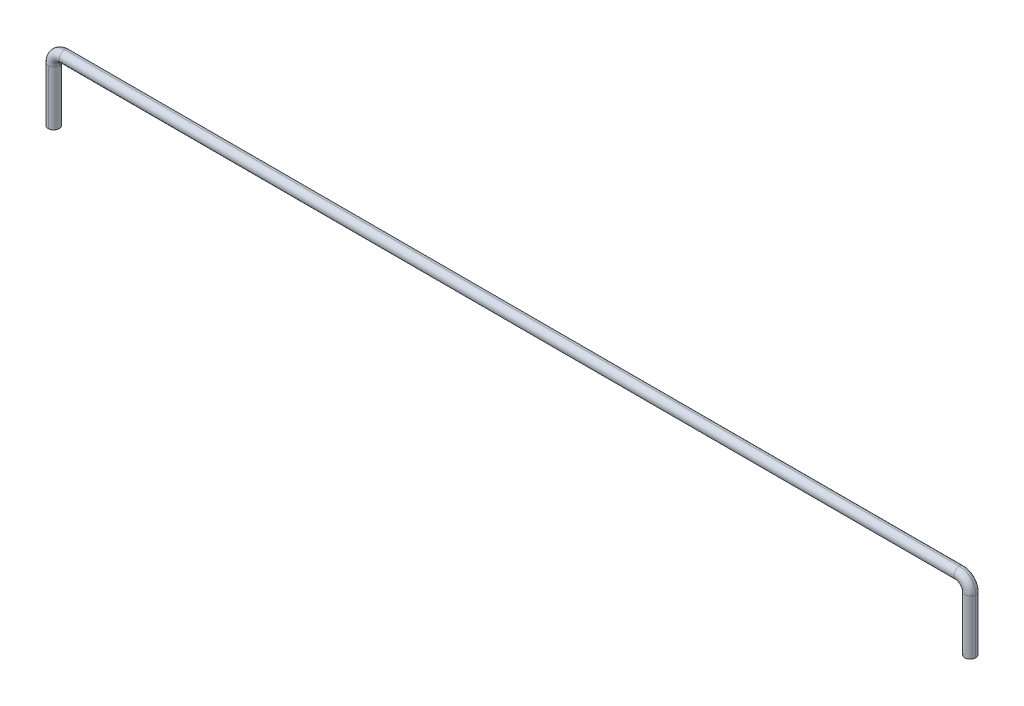
ISO-10303-21;
HEADER;
FILE_DESCRIPTION(('STEP AP214'),'2;1');
FILE_NAME('part.step','',(''),(''),'','','');
FILE_SCHEMA(('AUTOMOTIVE_DESIGN { 1 0 10303 214 1 1 1 1 }'));
ENDSEC;
DATA;
#1=APPLICATION_CONTEXT('core data for automotive mechanical design processes');
#2=APPLICATION_PROTOCOL_DEFINITION('international standard','automotive_design',2000,#1);
#3=PRODUCT_CONTEXT('',#1,'mechanical');
#4=PRODUCT('Part','Part','',(#3));
#5=PRODUCT_RELATED_PRODUCT_CATEGORY('part','',(#4));
#6=PRODUCT_DEFINITION_FORMATION('','',#4);
#7=PRODUCT_DEFINITION_CONTEXT('part definition',#1,'design');
#8=PRODUCT_DEFINITION('design','',#6,#7);
#9=PRODUCT_DEFINITION_SHAPE('','',#8);
#10=(LENGTH_UNIT() NAMED_UNIT(*) SI_UNIT(.MILLI.,.METRE.));
#11=(NAMED_UNIT(*) PLANE_ANGLE_UNIT() SI_UNIT($,.RADIAN.));
#12=(NAMED_UNIT(*) SI_UNIT($,.STERADIAN.) SOLID_ANGLE_UNIT());
#13=UNCERTAINTY_MEASURE_WITH_UNIT(LENGTH_MEASURE(1.E-05),#10,'distance_accuracy_value','');
#14=(GEOMETRIC_REPRESENTATION_CONTEXT(3) GLOBAL_UNCERTAINTY_ASSIGNED_CONTEXT((#13)) GLOBAL_UNIT_ASSIGNED_CONTEXT((#10,
#11,#12)) REPRESENTATION_CONTEXT('',''));
#15=CARTESIAN_POINT('',(0.,0.,0.));
#16=DIRECTION('',(0.,0.,1.));
#17=DIRECTION('',(1.,0.,0.));
#18=AXIS2_PLACEMENT_3D('',#15,#16,#17);
#19=CARTESIAN_POINT('',(41.9,0.,0.));
#20=DIRECTION('',(0.,-1.,0.));
#21=DIRECTION('',(-1.,0.,0.));
#22=AXIS2_PLACEMENT_3D('',#19,#20,#21);
#23=PLANE('',#22);
#24=CARTESIAN_POINT('',(41.9,0.,0.));
#25=DIRECTION('',(0.,-1.,0.));
#26=DIRECTION('',(0.,0.,1.));
#27=AXIS2_PLACEMENT_3D('',#24,#25,#26);
#28=CIRCLE('',#27,0.25);
#29=CARTESIAN_POINT('',(42.15,0.,0.));
#30=VERTEX_POINT('',#29);
#31=CARTESIAN_POINT('',(41.65,0.,0.));
#32=VERTEX_POINT('',#31);
#33=EDGE_CURVE('E92',#30,#32,#28,.T.);
#34=ORIENTED_EDGE('',*,*,#33,.T.);
#35=CARTESIAN_POINT('',(41.9,0.,0.));
#36=DIRECTION('',(0.,-1.,0.));
#37=DIRECTION('',(0.,0.,1.));
#38=AXIS2_PLACEMENT_3D('',#35,#36,#37);
#39=CIRCLE('',#38,0.25);
#40=EDGE_CURVE('E11',#32,#30,#39,.T.);
#41=ORIENTED_EDGE('',*,*,#40,.T.);
#42=EDGE_LOOP('',(#34,#41));
#43=FACE_BOUND('',#42,.T.);
#44=ADVANCED_FACE('F16',(#43),#23,.T.);
#45=CARTESIAN_POINT('',(0.5,2.5,0.));
#46=DIRECTION('',(0.,0.,-1.));
#47=DIRECTION('',(-1.,0.,0.));
#48=AXIS2_PLACEMENT_3D('',#45,#46,#47);
#49=TOROIDAL_SURFACE('',#48,0.5,0.25);
#50=CARTESIAN_POINT('',(0.5,2.5,0.));
#51=DIRECTION('',(0.,0.,-1.));
#52=DIRECTION('',(-1.,0.,0.));
#53=AXIS2_PLACEMENT_3D('',#50,#51,#52);
#54=CIRCLE('',#53,0.75);
#55=CARTESIAN_POINT('',(-0.25,2.5,0.));
#56=VERTEX_POINT('',#55);
#57=CARTESIAN_POINT('',(0.5,3.25,0.));
#58=VERTEX_POINT('',#57);
#59=EDGE_CURVE('E131',#56,#58,#54,.T.);
#60=ORIENTED_EDGE('',*,*,#59,.F.);
#61=CARTESIAN_POINT('',(0.,2.5,0.));
#62=DIRECTION('',(0.,1.,0.));
#63=DIRECTION('',(0.,0.,1.));
#64=AXIS2_PLACEMENT_3D('',#61,#62,#63);
#65=CIRCLE('',#64,0.25);
#66=CARTESIAN_POINT('',(0.,2.5,0.25));
#67=VERTEX_POINT('',#66);
#68=EDGE_CURVE('E156',#56,#67,#65,.T.);
#69=ORIENTED_EDGE('',*,*,#68,.T.);
#70=CARTESIAN_POINT('',(0.,2.5,0.));
#71=DIRECTION('',(0.,1.,0.));
#72=DIRECTION('',(0.,0.,1.));
#73=AXIS2_PLACEMENT_3D('',#70,#71,#72);
#74=CIRCLE('',#73,0.25);
#75=CARTESIAN_POINT('',(0.25,2.5,0.));
#76=VERTEX_POINT('',#75);
#77=EDGE_CURVE('E128',#67,#76,#74,.T.);
#78=ORIENTED_EDGE('',*,*,#77,.T.);
#79=CARTESIAN_POINT('',(0.5,2.5,0.));
#80=DIRECTION('',(0.,0.,-1.));
#81=DIRECTION('',(-1.,0.,0.));
#82=AXIS2_PLACEMENT_3D('',#79,#80,#81);
#83=CIRCLE('',#82,0.25);
#84=CARTESIAN_POINT('',(0.5,2.75,0.));
#85=VERTEX_POINT('',#84);
#86=EDGE_CURVE('E140',#76,#85,#83,.T.);
#87=ORIENTED_EDGE('',*,*,#86,.T.);
#88=CARTESIAN_POINT('',(0.5,3.,0.));
#89=DIRECTION('',(1.,0.,0.));
#90=DIRECTION('',(0.,0.,1.));
#91=AXIS2_PLACEMENT_3D('',#88,#89,#90);
#92=CIRCLE('',#91,0.25);
#93=EDGE_CURVE('E152',#58,#85,#92,.T.);
#94=ORIENTED_EDGE('',*,*,#93,.F.);
#95=EDGE_LOOP('',(#60,#69,#78,#87,#94));
#96=FACE_BOUND('',#95,.T.);
#97=ADVANCED_FACE('F181',(#96),#49,.T.);
#98=CARTESIAN_POINT('',(0.5,3.,0.));
#99=DIRECTION('',(1.,0.,0.));
#100=DIRECTION('',(0.,1.,0.));
#101=AXIS2_PLACEMENT_3D('',#98,#99,#100);
#102=CYLINDRICAL_SURFACE('',#101,0.25);
#103=DIRECTION('',(1.,0.,0.));
#104=VECTOR('',#103,1.);
#105=CARTESIAN_POINT('',(0.5,2.75,0.));
#106=LINE('',#105,#104);
#107=CARTESIAN_POINT('',(41.4,2.75,0.));
#108=VERTEX_POINT('',#107);
#109=EDGE_CURVE('E147',#85,#108,#106,.T.);
#110=ORIENTED_EDGE('',*,*,#109,.F.);
#111=CARTESIAN_POINT('',(0.5,3.,0.));
#112=DIRECTION('',(1.,0.,0.));
#113=DIRECTION('',(0.,0.,1.));
#114=AXIS2_PLACEMENT_3D('',#111,#112,#113);
#115=CIRCLE('',#114,0.25);
#116=EDGE_CURVE('E134',#85,#58,#115,.T.);
#117=ORIENTED_EDGE('',*,*,#116,.T.);
#118=DIRECTION('',(1.,0.,0.));
#119=VECTOR('',#118,1.);
#120=CARTESIAN_POINT('',(0.5,3.25,0.));
#121=LINE('',#120,#119);
#122=CARTESIAN_POINT('',(41.4,3.25,0.));
#123=VERTEX_POINT('',#122);
#124=EDGE_CURVE('E146',#58,#123,#121,.T.);
#125=ORIENTED_EDGE('',*,*,#124,.T.);
#126=CARTESIAN_POINT('',(41.4,3.,0.));
#127=DIRECTION('',(1.,0.,0.));
#128=DIRECTION('',(0.,0.,1.));
#129=AXIS2_PLACEMENT_3D('',#126,#127,#128);
#130=CIRCLE('',#129,0.25);
#131=EDGE_CURVE('E125',#108,#123,#130,.T.);
#132=ORIENTED_EDGE('',*,*,#131,.F.);
#133=EDGE_LOOP('',(#110,#117,#125,#132));
#134=FACE_BOUND('',#133,.T.);
#135=ADVANCED_FACE('F172',(#134),#102,.T.);
#136=CARTESIAN_POINT('',(41.4,2.5,0.));
#137=DIRECTION('',(0.,0.,-1.));
#138=DIRECTION('',(-1.,0.,0.));
#139=AXIS2_PLACEMENT_3D('',#136,#137,#138);
#140=TOROIDAL_SURFACE('',#139,0.5,0.25);
#141=CARTESIAN_POINT('',(41.4,2.5,0.));
#142=DIRECTION('',(0.,0.,-1.));
#143=DIRECTION('',(-1.,0.,0.));
#144=AXIS2_PLACEMENT_3D('',#141,#142,#143);
#145=CIRCLE('',#144,0.75);
#146=CARTESIAN_POINT('',(42.15,2.5,0.));
#147=VERTEX_POINT('',#146);
#148=EDGE_CURVE('E118',#123,#147,#145,.T.);
#149=ORIENTED_EDGE('',*,*,#148,.F.);
#150=CARTESIAN_POINT('',(41.4,3.,0.));
#151=DIRECTION('',(1.,0.,0.));
#152=DIRECTION('',(0.,0.,1.));
#153=AXIS2_PLACEMENT_3D('',#150,#151,#152);
#154=CIRCLE('',#153,0.25);
#155=EDGE_CURVE('E110',#123,#108,#154,.T.);
#156=ORIENTED_EDGE('',*,*,#155,.T.);
#157=CARTESIAN_POINT('',(41.4,2.5,0.));
#158=DIRECTION('',(0.,0.,-1.));
#159=DIRECTION('',(-1.,0.,0.));
#160=AXIS2_PLACEMENT_3D('',#157,#158,#159);
#161=CIRCLE('',#160,0.250000000000007);
#162=CARTESIAN_POINT('',(41.65,2.5,0.));
#163=VERTEX_POINT('',#162);
#164=EDGE_CURVE('E106',#108,#163,#161,.T.);
#165=ORIENTED_EDGE('',*,*,#164,.T.);
#166=CARTESIAN_POINT('',(41.9,2.5,0.));
#167=DIRECTION('',(0.,-1.,0.));
#168=DIRECTION('',(0.,0.,1.));
#169=AXIS2_PLACEMENT_3D('',#166,#167,#168);
#170=CIRCLE('',#169,0.25);
#171=EDGE_CURVE('E93',#147,#163,#170,.T.);
#172=ORIENTED_EDGE('',*,*,#171,.F.);
#173=EDGE_LOOP('',(#149,#156,#165,#172));
#174=FACE_BOUND('',#173,.T.);
#175=ADVANCED_FACE('F107',(#174),#140,.T.);
#176=CARTESIAN_POINT('',(41.9,2.5,0.));
#177=DIRECTION('',(0.,-1.,0.));
#178=DIRECTION('',(1.,0.,0.));
#179=AXIS2_PLACEMENT_3D('',#176,#177,#178);
#180=CYLINDRICAL_SURFACE('',#179,0.25);
#181=DIRECTION('',(0.,-1.,0.));
#182=VECTOR('',#181,1.);
#183=CARTESIAN_POINT('',(41.65,2.5,0.));
#184=LINE('',#183,#182);
#185=EDGE_CURVE('E81',#163,#32,#184,.T.);
#186=ORIENTED_EDGE('',*,*,#185,.F.);
#187=CARTESIAN_POINT('',(41.9,2.5,0.));
#188=DIRECTION('',(0.,-1.,0.));
#189=DIRECTION('',(0.,0.,1.));
#190=AXIS2_PLACEMENT_3D('',#187,#188,#189);
#191=CIRCLE('',#190,0.25);
#192=EDGE_CURVE('E86',#163,#147,#191,.T.);
#193=ORIENTED_EDGE('',*,*,#192,.T.);
#194=DIRECTION('',(0.,-1.,0.));
#195=VECTOR('',#194,1.);
#196=CARTESIAN_POINT('',(42.15,2.5,0.));
#197=LINE('',#196,#195);
#198=EDGE_CURVE('E98',#147,#30,#197,.T.);
#199=ORIENTED_EDGE('',*,*,#198,.T.);
#200=ORIENTED_EDGE('',*,*,#40,.F.);
#201=EDGE_LOOP('',(#186,#193,#199,#200));
#202=FACE_BOUND('',#201,.T.);
#203=ADVANCED_FACE('F83',(#202),#180,.T.);
#204=CARTESIAN_POINT('',(0.,0.,0.));
#205=DIRECTION('',(0.,1.,0.));
#206=DIRECTION('',(1.,0.,0.));
#207=AXIS2_PLACEMENT_3D('',#204,#205,#206);
#208=PLANE('',#207);
#209=CARTESIAN_POINT('',(0.,0.,0.));
#210=DIRECTION('',(0.,1.,0.));
#211=DIRECTION('',(0.,0.,1.));
#212=AXIS2_PLACEMENT_3D('',#209,#210,#211);
#213=CIRCLE('',#212,0.25);
#214=CARTESIAN_POINT('',(0.,0.,-0.25));
#215=VERTEX_POINT('',#214);
#216=CARTESIAN_POINT('',(0.,0.,0.25));
#217=VERTEX_POINT('',#216);
#218=EDGE_CURVE('E26',#215,#217,#213,.T.);
#219=ORIENTED_EDGE('',*,*,#218,.F.);
#220=CARTESIAN_POINT('',(0.,0.,0.));
#221=DIRECTION('',(0.,1.,0.));
#222=DIRECTION('',(0.,0.,1.));
#223=AXIS2_PLACEMENT_3D('',#220,#221,#222);
#224=CIRCLE('',#223,0.25);
#225=EDGE_CURVE('E148',#217,#215,#224,.T.);
#226=ORIENTED_EDGE('',*,*,#225,.F.);
#227=EDGE_LOOP('',(#219,#226));
#228=FACE_BOUND('',#227,.T.);
#229=ADVANCED_FACE('F265',(#228),#208,.F.);
#230=CARTESIAN_POINT('',(0.,2.,0.));
#231=DIRECTION('',(0.,-1.,0.));
#232=DIRECTION('',(0.,0.,-1.));
#233=AXIS2_PLACEMENT_3D('',#230,#231,#232);
#234=CYLINDRICAL_SURFACE('',#233,0.25);
#235=DIRECTION('',(0.,-1.,0.));
#236=VECTOR('',#235,1.);
#237=CARTESIAN_POINT('',(0.,2.,0.25));
#238=LINE('',#237,#236);
#239=EDGE_CURVE('E151',#67,#217,#238,.T.);
#240=ORIENTED_EDGE('',*,*,#239,.F.);
#241=ORIENTED_EDGE('',*,*,#68,.F.);
#242=CARTESIAN_POINT('',(0.,2.5,0.));
#243=DIRECTION('',(0.,1.,0.));
#244=DIRECTION('',(0.,0.,1.));
#245=AXIS2_PLACEMENT_3D('',#242,#243,#244);
#246=CIRCLE('',#245,0.25);
#247=CARTESIAN_POINT('',(0.,2.5,-0.25));
#248=VERTEX_POINT('',#247);
#249=EDGE_CURVE('E19',#248,#56,#246,.T.);
#250=ORIENTED_EDGE('',*,*,#249,.F.);
#251=DIRECTION('',(0.,-1.,0.));
#252=VECTOR('',#251,1.);
#253=CARTESIAN_POINT('',(0.,2.,-0.25));
#254=LINE('',#253,#252);
#255=EDGE_CURVE('E69',#248,#215,#254,.T.);
#256=ORIENTED_EDGE('',*,*,#255,.T.);
#257=ORIENTED_EDGE('',*,*,#218,.T.);
#258=EDGE_LOOP('',(#240,#241,#250,#256,#257));
#259=FACE_BOUND('',#258,.T.);
#260=ADVANCED_FACE('F270',(#259),#234,.T.);
#261=CARTESIAN_POINT('',(0.,2.,0.));
#262=DIRECTION('',(0.,-1.,0.));
#263=DIRECTION('',(0.,0.,-1.));
#264=AXIS2_PLACEMENT_3D('',#261,#262,#263);
#265=CYLINDRICAL_SURFACE('',#264,0.25);
#266=ORIENTED_EDGE('',*,*,#77,.F.);
#267=ORIENTED_EDGE('',*,*,#239,.T.);
#268=ORIENTED_EDGE('',*,*,#225,.T.);
#269=ORIENTED_EDGE('',*,*,#255,.F.);
#270=CARTESIAN_POINT('',(0.,2.5,0.));
#271=DIRECTION('',(0.,1.,0.));
#272=DIRECTION('',(0.,0.,1.));
#273=AXIS2_PLACEMENT_3D('',#270,#271,#272);
#274=CIRCLE('',#273,0.25);
#275=EDGE_CURVE('E102',#76,#248,#274,.T.);
#276=ORIENTED_EDGE('',*,*,#275,.F.);
#277=EDGE_LOOP('',(#266,#267,#268,#269,#276));
#278=FACE_BOUND('',#277,.T.);
#279=ADVANCED_FACE('F234',(#278),#265,.T.);
#280=CARTESIAN_POINT('',(0.5,3.,0.));
#281=DIRECTION('',(1.,0.,0.));
#282=DIRECTION('',(0.,1.,0.));
#283=AXIS2_PLACEMENT_3D('',#280,#281,#282);
#284=CYLINDRICAL_SURFACE('',#283,0.25);
#285=ORIENTED_EDGE('',*,*,#93,.T.);
#286=ORIENTED_EDGE('',*,*,#109,.T.);
#287=ORIENTED_EDGE('',*,*,#155,.F.);
#288=ORIENTED_EDGE('',*,*,#124,.F.);
#289=EDGE_LOOP('',(#285,#286,#287,#288));
#290=FACE_BOUND('',#289,.T.);
#291=ADVANCED_FACE('F185',(#290),#284,.T.);
#292=CARTESIAN_POINT('',(41.9,2.5,0.));
#293=DIRECTION('',(0.,-1.,0.));
#294=DIRECTION('',(1.,0.,0.));
#295=AXIS2_PLACEMENT_3D('',#292,#293,#294);
#296=CYLINDRICAL_SURFACE('',#295,0.25);
#297=ORIENTED_EDGE('',*,*,#171,.T.);
#298=ORIENTED_EDGE('',*,*,#185,.T.);
#299=ORIENTED_EDGE('',*,*,#33,.F.);
#300=ORIENTED_EDGE('',*,*,#198,.F.);
#301=EDGE_LOOP('',(#297,#298,#299,#300));
#302=FACE_BOUND('',#301,.T.);
#303=ADVANCED_FACE('F97',(#302),#296,.T.);
#304=CARTESIAN_POINT('',(0.5,2.5,0.));
#305=DIRECTION('',(0.,0.,-1.));
#306=DIRECTION('',(-1.,0.,0.));
#307=AXIS2_PLACEMENT_3D('',#304,#305,#306);
#308=TOROIDAL_SURFACE('',#307,0.5,0.25);
#309=ORIENTED_EDGE('',*,*,#249,.T.);
#310=ORIENTED_EDGE('',*,*,#59,.T.);
#311=ORIENTED_EDGE('',*,*,#116,.F.);
#312=ORIENTED_EDGE('',*,*,#86,.F.);
#313=ORIENTED_EDGE('',*,*,#275,.T.);
#314=EDGE_LOOP('',(#309,#310,#311,#312,#313));
#315=FACE_BOUND('',#314,.T.);
#316=ADVANCED_FACE('F177',(#315),#308,.T.);
#317=CARTESIAN_POINT('',(41.4,2.5,0.));
#318=DIRECTION('',(0.,0.,-1.));
#319=DIRECTION('',(-1.,0.,0.));
#320=AXIS2_PLACEMENT_3D('',#317,#318,#319);
#321=TOROIDAL_SURFACE('',#320,0.5,0.25);
#322=ORIENTED_EDGE('',*,*,#131,.T.);
#323=ORIENTED_EDGE('',*,*,#148,.T.);
#324=ORIENTED_EDGE('',*,*,#192,.F.);
#325=ORIENTED_EDGE('',*,*,#164,.F.);
#326=EDGE_LOOP('',(#322,#323,#324,#325));
#327=FACE_BOUND('',#326,.T.);
#328=ADVANCED_FACE('F117',(#327),#321,.T.);
#329=CLOSED_SHELL('',(#44,#97,#135,#175,#203,#229,#260,#279,#291,#303,#316,#328));
#330=MANIFOLD_SOLID_BREP('B1',#329);
#331=ADVANCED_BREP_SHAPE_REPRESENTATION('',(#18,#330),#14);
#332=SHAPE_DEFINITION_REPRESENTATION(#9,#331);
ENDSEC;
END-ISO-10303-21;
